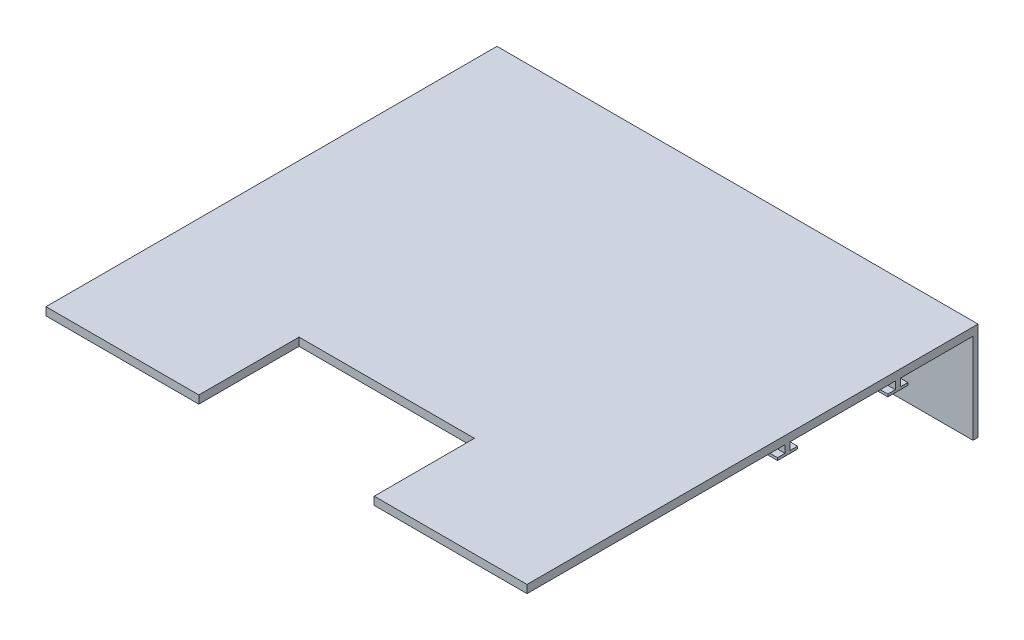
ISO-10303-21;
HEADER;
FILE_DESCRIPTION(('STEP AP214'),'2;1');
FILE_NAME('part.step','',(''),(''),'','','');
FILE_SCHEMA(('AUTOMOTIVE_DESIGN { 1 0 10303 214 1 1 1 1 }'));
ENDSEC;
DATA;
#1=APPLICATION_CONTEXT('core data for automotive mechanical design processes');
#2=APPLICATION_PROTOCOL_DEFINITION('international standard','automotive_design',2000,#1);
#3=PRODUCT_CONTEXT('',#1,'mechanical');
#4=PRODUCT('Part','Part','',(#3));
#5=PRODUCT_RELATED_PRODUCT_CATEGORY('part','',(#4));
#6=PRODUCT_DEFINITION_FORMATION('','',#4);
#7=PRODUCT_DEFINITION_CONTEXT('part definition',#1,'design');
#8=PRODUCT_DEFINITION('design','',#6,#7);
#9=PRODUCT_DEFINITION_SHAPE('','',#8);
#10=(LENGTH_UNIT() NAMED_UNIT(*) SI_UNIT(.MILLI.,.METRE.));
#11=(NAMED_UNIT(*) PLANE_ANGLE_UNIT() SI_UNIT($,.RADIAN.));
#12=(NAMED_UNIT(*) SI_UNIT($,.STERADIAN.) SOLID_ANGLE_UNIT());
#13=UNCERTAINTY_MEASURE_WITH_UNIT(LENGTH_MEASURE(1.E-05),#10,'distance_accuracy_value','');
#14=(GEOMETRIC_REPRESENTATION_CONTEXT(3) GLOBAL_UNCERTAINTY_ASSIGNED_CONTEXT((#13)) GLOBAL_UNIT_ASSIGNED_CONTEXT((#10,
#11,#12)) REPRESENTATION_CONTEXT('',''));
#15=CARTESIAN_POINT('',(0.,0.,0.));
#16=DIRECTION('',(0.,0.,1.));
#17=DIRECTION('',(1.,0.,0.));
#18=AXIS2_PLACEMENT_3D('',#15,#16,#17);
#19=CARTESIAN_POINT('',(0.,0.,0.));
#20=DIRECTION('',(0.,-1.,0.));
#21=DIRECTION('',(0.,0.,-1.));
#22=AXIS2_PLACEMENT_3D('',#19,#20,#21);
#23=PLANE('',#22);
#24=DIRECTION('',(-1.,0.,0.));
#25=VECTOR('',#24,1.);
#26=CARTESIAN_POINT('',(0.,0.,-262.5));
#27=LINE('',#26,#25);
#28=CARTESIAN_POINT('',(480.,0.,-262.5));
#29=VERTEX_POINT('',#28);
#30=CARTESIAN_POINT('',(0.,0.,-262.5));
#31=VERTEX_POINT('',#30);
#32=EDGE_CURVE('E62',#29,#31,#27,.T.);
#33=ORIENTED_EDGE('',*,*,#32,.T.);
#34=DIRECTION('',(0.,0.,1.));
#35=VECTOR('',#34,1.);
#36=CARTESIAN_POINT('',(0.,0.,0.));
#37=LINE('',#36,#35);
#38=CARTESIAN_POINT('',(0.,0.,-367.5));
#39=VERTEX_POINT('',#38);
#40=EDGE_CURVE('E400',#39,#31,#37,.T.);
#41=ORIENTED_EDGE('',*,*,#40,.F.);
#42=DIRECTION('',(-1.,0.,0.));
#43=VECTOR('',#42,1.);
#44=CARTESIAN_POINT('',(0.,0.,-367.5));
#45=LINE('',#44,#43);
#46=CARTESIAN_POINT('',(480.,0.,-367.5));
#47=VERTEX_POINT('',#46);
#48=EDGE_CURVE('E320',#47,#39,#45,.T.);
#49=ORIENTED_EDGE('',*,*,#48,.F.);
#50=DIRECTION('',(0.,0.,-1.));
#51=VECTOR('',#50,1.);
#52=CARTESIAN_POINT('',(480.,0.,0.));
#53=LINE('',#52,#51);
#54=EDGE_CURVE('E406',#29,#47,#53,.T.);
#55=ORIENTED_EDGE('',*,*,#54,.F.);
#56=EDGE_LOOP('',(#33,#41,#49,#55));
#57=FACE_BOUND('',#56,.T.);
#58=ADVANCED_FACE('F47',(#57),#23,.T.);
#59=CARTESIAN_POINT('',(480.,0.,-372.5));
#60=VERTEX_POINT('',#59);
#61=CARTESIAN_POINT('',(480.,0.,-445.));
#62=VERTEX_POINT('',#61);
#63=EDGE_CURVE('E404',#60,#62,#53,.T.);
#64=ORIENTED_EDGE('',*,*,#63,.F.);
#65=DIRECTION('',(1.,0.,0.));
#66=VECTOR('',#65,1.);
#67=CARTESIAN_POINT('',(0.,0.,-372.5));
#68=LINE('',#67,#66);
#69=CARTESIAN_POINT('',(0.,0.,-372.5));
#70=VERTEX_POINT('',#69);
#71=EDGE_CURVE('E315',#70,#60,#68,.T.);
#72=ORIENTED_EDGE('',*,*,#71,.F.);
#73=CARTESIAN_POINT('',(0.,0.,-445.));
#74=VERTEX_POINT('',#73);
#75=EDGE_CURVE('E396',#74,#70,#37,.T.);
#76=ORIENTED_EDGE('',*,*,#75,.F.);
#77=DIRECTION('',(-1.,0.,0.));
#78=VECTOR('',#77,1.);
#79=CARTESIAN_POINT('',(5.,0.,-445.));
#80=LINE('',#79,#78);
#81=EDGE_CURVE('E334',#62,#74,#80,.T.);
#82=ORIENTED_EDGE('',*,*,#81,.F.);
#83=EDGE_LOOP('',(#64,#72,#76,#82));
#84=FACE_BOUND('',#83,.T.);
#85=ADVANCED_FACE('F469',(#84),#23,.T.);
#86=DIRECTION('',(1.,0.,0.));
#87=VECTOR('',#86,1.);
#88=CARTESIAN_POINT('',(0.,0.,-257.5));
#89=LINE('',#88,#87);
#90=CARTESIAN_POINT('',(0.,0.,-257.5));
#91=VERTEX_POINT('',#90);
#92=CARTESIAN_POINT('',(480.,0.,-257.5));
#93=VERTEX_POINT('',#92);
#94=EDGE_CURVE('E269',#91,#93,#89,.T.);
#95=ORIENTED_EDGE('',*,*,#94,.T.);
#96=CARTESIAN_POINT('',(480.,0.,0.));
#97=VERTEX_POINT('',#96);
#98=EDGE_CURVE('E387',#97,#93,#53,.T.);
#99=ORIENTED_EDGE('',*,*,#98,.F.);
#100=DIRECTION('',(1.,0.,0.));
#101=VECTOR('',#100,1.);
#102=CARTESIAN_POINT('',(0.,0.,0.));
#103=LINE('',#102,#101);
#104=CARTESIAN_POINT('',(327.5,0.,0.));
#105=VERTEX_POINT('',#104);
#106=EDGE_CURVE('E399',#105,#97,#103,.T.);
#107=ORIENTED_EDGE('',*,*,#106,.F.);
#108=DIRECTION('',(0.,0.,1.));
#109=VECTOR('',#108,1.);
#110=CARTESIAN_POINT('',(327.5,0.,1.81799020282369E-13));
#111=LINE('',#110,#109);
#112=CARTESIAN_POINT('',(327.5,0.,-100.));
#113=VERTEX_POINT('',#112);
#114=EDGE_CURVE('E416',#113,#105,#111,.T.);
#115=ORIENTED_EDGE('',*,*,#114,.F.);
#116=DIRECTION('',(1.,0.,0.));
#117=VECTOR('',#116,1.);
#118=CARTESIAN_POINT('',(0.,0.,-100.));
#119=LINE('',#118,#117);
#120=CARTESIAN_POINT('',(152.5,0.,-100.));
#121=VERTEX_POINT('',#120);
#122=EDGE_CURVE('E55',#121,#113,#119,.T.);
#123=ORIENTED_EDGE('',*,*,#122,.F.);
#124=DIRECTION('',(0.,0.,-1.));
#125=VECTOR('',#124,1.);
#126=CARTESIAN_POINT('',(152.5,0.,0.));
#127=LINE('',#126,#125);
#128=CARTESIAN_POINT('',(152.5,0.,0.));
#129=VERTEX_POINT('',#128);
#130=EDGE_CURVE('E13',#129,#121,#127,.T.);
#131=ORIENTED_EDGE('',*,*,#130,.F.);
#132=CARTESIAN_POINT('',(0.,0.,0.));
#133=VERTEX_POINT('',#132);
#134=EDGE_CURVE('E401',#133,#129,#103,.T.);
#135=ORIENTED_EDGE('',*,*,#134,.F.);
#136=EDGE_CURVE('E376',#91,#133,#37,.T.);
#137=ORIENTED_EDGE('',*,*,#136,.F.);
#138=EDGE_LOOP('',(#95,#99,#107,#115,#123,#131,#135,#137));
#139=FACE_BOUND('',#138,.T.);
#140=CARTESIAN_POINT('',(450.,0.,-217.));
#141=DIRECTION('',(0.,-1.,0.));
#142=DIRECTION('',(0.,0.,1.));
#143=AXIS2_PLACEMENT_3D('',#140,#141,#142);
#144=CIRCLE('',#143,3.49999999999996);
#145=CARTESIAN_POINT('',(450.,0.,-213.5));
#146=VERTEX_POINT('',#145);
#147=EDGE_CURVE('E353',#146,#146,#144,.T.);
#148=ORIENTED_EDGE('',*,*,#147,.F.);
#149=EDGE_LOOP('',(#148));
#150=FACE_BOUND('',#149,.T.);
#151=CARTESIAN_POINT('',(30.,0.,-217.));
#152=DIRECTION('',(0.,-1.,0.));
#153=DIRECTION('',(0.,0.,-1.));
#154=AXIS2_PLACEMENT_3D('',#151,#152,#153);
#155=CIRCLE('',#154,3.5);
#156=CARTESIAN_POINT('',(30.,0.,-220.5));
#157=VERTEX_POINT('',#156);
#158=EDGE_CURVE('E357',#157,#157,#155,.T.);
#159=ORIENTED_EDGE('',*,*,#158,.F.);
#160=EDGE_LOOP('',(#159));
#161=FACE_BOUND('',#160,.T.);
#162=ADVANCED_FACE('F426',(#139,#150,#161),#23,.T.);
#163=CARTESIAN_POINT('',(0.,8.,0.));
#164=DIRECTION('',(0.,0.,-1.));
#165=DIRECTION('',(-1.,0.,0.));
#166=AXIS2_PLACEMENT_3D('',#163,#164,#165);
#167=PLANE('',#166);
#168=ORIENTED_EDGE('',*,*,#134,.T.);
#169=DIRECTION('',(0.,1.,0.));
#170=VECTOR('',#169,1.);
#171=CARTESIAN_POINT('',(152.5,-2.,0.));
#172=LINE('',#171,#170);
#173=CARTESIAN_POINT('',(152.5,8.,0.));
#174=VERTEX_POINT('',#173);
#175=EDGE_CURVE('E373',#129,#174,#172,.T.);
#176=ORIENTED_EDGE('',*,*,#175,.T.);
#177=DIRECTION('',(1.,0.,0.));
#178=VECTOR('',#177,1.);
#179=CARTESIAN_POINT('',(0.,8.,0.));
#180=LINE('',#179,#178);
#181=CARTESIAN_POINT('',(0.,8.,0.));
#182=VERTEX_POINT('',#181);
#183=EDGE_CURVE('E388',#182,#174,#180,.T.);
#184=ORIENTED_EDGE('',*,*,#183,.F.);
#185=DIRECTION('',(0.,-1.,0.));
#186=VECTOR('',#185,1.);
#187=CARTESIAN_POINT('',(0.,8.,0.));
#188=LINE('',#187,#186);
#189=EDGE_CURVE('E413',#182,#133,#188,.T.);
#190=ORIENTED_EDGE('',*,*,#189,.T.);
#191=EDGE_LOOP('',(#168,#176,#184,#190));
#192=FACE_BOUND('',#191,.T.);
#193=ADVANCED_FACE('F446',(#192),#167,.F.);
#194=CARTESIAN_POINT('',(0.,8.,0.));
#195=DIRECTION('',(1.,0.,0.));
#196=DIRECTION('',(0.,0.,-1.));
#197=AXIS2_PLACEMENT_3D('',#194,#195,#196);
#198=PLANE('',#197);
#199=DIRECTION('',(0.,-1.,0.));
#200=VECTOR('',#199,1.);
#201=CARTESIAN_POINT('',(0.,8.,-450.));
#202=LINE('',#201,#200);
#203=CARTESIAN_POINT('',(0.,8.,-450.));
#204=VERTEX_POINT('',#203);
#205=CARTESIAN_POINT('',(0.,-90.,-450.));
#206=VERTEX_POINT('',#205);
#207=EDGE_CURVE('E395',#204,#206,#202,.T.);
#208=ORIENTED_EDGE('',*,*,#207,.T.);
#209=DIRECTION('',(0.,0.,-1.));
#210=VECTOR('',#209,1.);
#211=CARTESIAN_POINT('',(0.,-90.,-445.));
#212=LINE('',#211,#210);
#213=CARTESIAN_POINT('',(0.,-90.,-445.));
#214=VERTEX_POINT('',#213);
#215=EDGE_CURVE('E340',#214,#206,#212,.T.);
#216=ORIENTED_EDGE('',*,*,#215,.F.);
#217=DIRECTION('',(0.,1.,0.));
#218=VECTOR('',#217,1.);
#219=CARTESIAN_POINT('',(0.,-90.,-445.));
#220=LINE('',#219,#218);
#221=EDGE_CURVE('E346',#214,#74,#220,.T.);
#222=ORIENTED_EDGE('',*,*,#221,.T.);
#223=ORIENTED_EDGE('',*,*,#75,.T.);
#224=DIRECTION('',(0.,1.,0.));
#225=VECTOR('',#224,1.);
#226=CARTESIAN_POINT('',(0.,-7.5,-372.5));
#227=LINE('',#226,#225);
#228=CARTESIAN_POINT('',(0.,-7.5,-372.5));
#229=VERTEX_POINT('',#228);
#230=EDGE_CURVE('E332',#229,#70,#227,.T.);
#231=ORIENTED_EDGE('',*,*,#230,.F.);
#232=DIRECTION('',(0.,0.,-1.));
#233=VECTOR('',#232,1.);
#234=CARTESIAN_POINT('',(0.,-7.5,-360.));
#235=LINE('',#234,#233);
#236=CARTESIAN_POINT('',(0.,-7.5,-380.));
#237=VERTEX_POINT('',#236);
#238=EDGE_CURVE('E299',#229,#237,#235,.T.);
#239=ORIENTED_EDGE('',*,*,#238,.T.);
#240=DIRECTION('',(0.,1.,0.));
#241=VECTOR('',#240,1.);
#242=CARTESIAN_POINT('',(0.,-10.,-380.));
#243=LINE('',#242,#241);
#244=CARTESIAN_POINT('',(0.,-10.,-380.));
#245=VERTEX_POINT('',#244);
#246=EDGE_CURVE('E306',#245,#237,#243,.T.);
#247=ORIENTED_EDGE('',*,*,#246,.F.);
#248=DIRECTION('',(0.,0.,-1.));
#249=VECTOR('',#248,1.);
#250=CARTESIAN_POINT('',(0.,-10.,-360.));
#251=LINE('',#250,#249);
#252=CARTESIAN_POINT('',(0.,-10.,-360.));
#253=VERTEX_POINT('',#252);
#254=EDGE_CURVE('E290',#253,#245,#251,.T.);
#255=ORIENTED_EDGE('',*,*,#254,.F.);
#256=DIRECTION('',(0.,1.,0.));
#257=VECTOR('',#256,1.);
#258=CARTESIAN_POINT('',(0.,-10.,-360.));
#259=LINE('',#258,#257);
#260=CARTESIAN_POINT('',(0.,-7.5,-360.));
#261=VERTEX_POINT('',#260);
#262=EDGE_CURVE('E309',#253,#261,#259,.T.);
#263=ORIENTED_EDGE('',*,*,#262,.T.);
#264=CARTESIAN_POINT('',(0.,-7.5,-367.5));
#265=VERTEX_POINT('',#264);
#266=EDGE_CURVE('E300',#261,#265,#235,.T.);
#267=ORIENTED_EDGE('',*,*,#266,.T.);
#268=DIRECTION('',(0.,1.,0.));
#269=VECTOR('',#268,1.);
#270=CARTESIAN_POINT('',(0.,-7.5,-367.5));
#271=LINE('',#270,#269);
#272=EDGE_CURVE('E323',#265,#39,#271,.T.);
#273=ORIENTED_EDGE('',*,*,#272,.T.);
#274=ORIENTED_EDGE('',*,*,#40,.T.);
#275=DIRECTION('',(0.,1.,0.));
#276=VECTOR('',#275,1.);
#277=CARTESIAN_POINT('',(0.,-7.5,-262.5));
#278=LINE('',#277,#276);
#279=CARTESIAN_POINT('',(0.,-7.5,-262.5));
#280=VERTEX_POINT('',#279);
#281=EDGE_CURVE('E281',#280,#31,#278,.T.);
#282=ORIENTED_EDGE('',*,*,#281,.F.);
#283=DIRECTION('',(0.,0.,1.));
#284=VECTOR('',#283,1.);
#285=CARTESIAN_POINT('',(0.,-7.5,-270.));
#286=LINE('',#285,#284);
#287=CARTESIAN_POINT('',(0.,-7.5,-270.));
#288=VERTEX_POINT('',#287);
#289=EDGE_CURVE('E257',#288,#280,#286,.T.);
#290=ORIENTED_EDGE('',*,*,#289,.F.);
#291=DIRECTION('',(0.,1.,0.));
#292=VECTOR('',#291,1.);
#293=CARTESIAN_POINT('',(0.,-10.,-270.));
#294=LINE('',#293,#292);
#295=CARTESIAN_POINT('',(0.,-10.,-270.));
#296=VERTEX_POINT('',#295);
#297=EDGE_CURVE('E262',#296,#288,#294,.T.);
#298=ORIENTED_EDGE('',*,*,#297,.F.);
#299=DIRECTION('',(0.,0.,1.));
#300=VECTOR('',#299,1.);
#301=CARTESIAN_POINT('',(0.,-10.,-270.));
#302=LINE('',#301,#300);
#303=CARTESIAN_POINT('',(0.,-10.,-250.));
#304=VERTEX_POINT('',#303);
#305=EDGE_CURVE('E246',#296,#304,#302,.T.);
#306=ORIENTED_EDGE('',*,*,#305,.T.);
#307=DIRECTION('',(0.,1.,0.));
#308=VECTOR('',#307,1.);
#309=CARTESIAN_POINT('',(0.,-10.,-250.));
#310=LINE('',#309,#308);
#311=CARTESIAN_POINT('',(0.,-7.5,-250.));
#312=VERTEX_POINT('',#311);
#313=EDGE_CURVE('E232',#304,#312,#310,.T.);
#314=ORIENTED_EDGE('',*,*,#313,.T.);
#315=CARTESIAN_POINT('',(0.,-7.5,-257.5));
#316=VERTEX_POINT('',#315);
#317=EDGE_CURVE('E256',#316,#312,#286,.T.);
#318=ORIENTED_EDGE('',*,*,#317,.F.);
#319=DIRECTION('',(0.,1.,0.));
#320=VECTOR('',#319,1.);
#321=CARTESIAN_POINT('',(0.,-7.5,-257.5));
#322=LINE('',#321,#320);
#323=EDGE_CURVE('E272',#316,#91,#322,.T.);
#324=ORIENTED_EDGE('',*,*,#323,.T.);
#325=ORIENTED_EDGE('',*,*,#136,.T.);
#326=ORIENTED_EDGE('',*,*,#189,.F.);
#327=DIRECTION('',(0.,0.,1.));
#328=VECTOR('',#327,1.);
#329=CARTESIAN_POINT('',(0.,8.,0.));
#330=LINE('',#329,#328);
#331=EDGE_CURVE('E383',#204,#182,#330,.T.);
#332=ORIENTED_EDGE('',*,*,#331,.F.);
#333=EDGE_LOOP('',(#208,#216,#222,#223,#231,#239,#247,#255,#263,#267,#273,#274,#282,#290,#298,
#306,#314,#318,#324,#325,#326,#332));
#334=FACE_BOUND('',#333,.T.);
#335=ADVANCED_FACE('F49',(#334),#198,.F.);
#336=CARTESIAN_POINT('',(327.5,8.,0.));
#337=VERTEX_POINT('',#336);
#338=CARTESIAN_POINT('',(480.,8.,0.));
#339=VERTEX_POINT('',#338);
#340=EDGE_CURVE('E386',#337,#339,#180,.T.);
#341=ORIENTED_EDGE('',*,*,#340,.F.);
#342=DIRECTION('',(0.,1.,0.));
#343=VECTOR('',#342,1.);
#344=CARTESIAN_POINT('',(327.5,-2.,0.));
#345=LINE('',#344,#343);
#346=EDGE_CURVE('E379',#105,#337,#345,.T.);
#347=ORIENTED_EDGE('',*,*,#346,.F.);
#348=ORIENTED_EDGE('',*,*,#106,.T.);
#349=DIRECTION('',(0.,-1.,0.));
#350=VECTOR('',#349,1.);
#351=CARTESIAN_POINT('',(480.,8.,0.));
#352=LINE('',#351,#350);
#353=EDGE_CURVE('E410',#339,#97,#352,.T.);
#354=ORIENTED_EDGE('',*,*,#353,.F.);
#355=EDGE_LOOP('',(#341,#347,#348,#354));
#356=FACE_BOUND('',#355,.T.);
#357=ADVANCED_FACE('F435',(#356),#167,.F.);
#358=CARTESIAN_POINT('',(480.,8.,0.));
#359=DIRECTION('',(-1.,0.,0.));
#360=DIRECTION('',(0.,0.,1.));
#361=AXIS2_PLACEMENT_3D('',#358,#359,#360);
#362=PLANE('',#361);
#363=ORIENTED_EDGE('',*,*,#98,.T.);
#364=DIRECTION('',(0.,1.,0.));
#365=VECTOR('',#364,1.);
#366=CARTESIAN_POINT('',(480.,-7.5,-257.5));
#367=LINE('',#366,#365);
#368=CARTESIAN_POINT('',(480.,-7.5,-257.5));
#369=VERTEX_POINT('',#368);
#370=EDGE_CURVE('E277',#369,#93,#367,.T.);
#371=ORIENTED_EDGE('',*,*,#370,.F.);
#372=DIRECTION('',(0.,0.,-1.));
#373=VECTOR('',#372,1.);
#374=CARTESIAN_POINT('',(480.,-7.5,-270.));
#375=LINE('',#374,#373);
#376=CARTESIAN_POINT('',(480.,-7.5,-250.));
#377=VERTEX_POINT('',#376);
#378=EDGE_CURVE('E227',#377,#369,#375,.T.);
#379=ORIENTED_EDGE('',*,*,#378,.F.);
#380=DIRECTION('',(0.,1.,0.));
#381=VECTOR('',#380,1.);
#382=CARTESIAN_POINT('',(480.,-10.,-250.));
#383=LINE('',#382,#381);
#384=CARTESIAN_POINT('',(480.,-10.,-250.));
#385=VERTEX_POINT('',#384);
#386=EDGE_CURVE('E219',#385,#377,#383,.T.);
#387=ORIENTED_EDGE('',*,*,#386,.F.);
#388=DIRECTION('',(0.,0.,-1.));
#389=VECTOR('',#388,1.);
#390=CARTESIAN_POINT('',(480.,-10.,-270.));
#391=LINE('',#390,#389);
#392=CARTESIAN_POINT('',(480.,-10.,-270.));
#393=VERTEX_POINT('',#392);
#394=EDGE_CURVE('E224',#385,#393,#391,.T.);
#395=ORIENTED_EDGE('',*,*,#394,.T.);
#396=DIRECTION('',(0.,1.,0.));
#397=VECTOR('',#396,1.);
#398=CARTESIAN_POINT('',(480.,-10.,-270.));
#399=LINE('',#398,#397);
#400=CARTESIAN_POINT('',(480.,-7.5,-270.));
#401=VERTEX_POINT('',#400);
#402=EDGE_CURVE('E251',#393,#401,#399,.T.);
#403=ORIENTED_EDGE('',*,*,#402,.T.);
#404=CARTESIAN_POINT('',(480.,-7.5,-262.5));
#405=VERTEX_POINT('',#404);
#406=EDGE_CURVE('E254',#405,#401,#375,.T.);
#407=ORIENTED_EDGE('',*,*,#406,.F.);
#408=DIRECTION('',(0.,1.,0.));
#409=VECTOR('',#408,1.);
#410=CARTESIAN_POINT('',(480.,-7.5,-262.5));
#411=LINE('',#410,#409);
#412=EDGE_CURVE('E279',#405,#29,#411,.T.);
#413=ORIENTED_EDGE('',*,*,#412,.T.);
#414=ORIENTED_EDGE('',*,*,#54,.T.);
#415=DIRECTION('',(0.,1.,0.));
#416=VECTOR('',#415,1.);
#417=CARTESIAN_POINT('',(480.,-7.5,-367.5));
#418=LINE('',#417,#416);
#419=CARTESIAN_POINT('',(480.,-7.5,-367.5));
#420=VERTEX_POINT('',#419);
#421=EDGE_CURVE('E328',#420,#47,#418,.T.);
#422=ORIENTED_EDGE('',*,*,#421,.F.);
#423=DIRECTION('',(0.,0.,1.));
#424=VECTOR('',#423,1.);
#425=CARTESIAN_POINT('',(480.,-7.5,-360.));
#426=LINE('',#425,#424);
#427=CARTESIAN_POINT('',(480.,-7.5,-360.));
#428=VERTEX_POINT('',#427);
#429=EDGE_CURVE('E283',#420,#428,#426,.T.);
#430=ORIENTED_EDGE('',*,*,#429,.T.);
#431=DIRECTION('',(0.,1.,0.));
#432=VECTOR('',#431,1.);
#433=CARTESIAN_POINT('',(480.,-10.,-360.));
#434=LINE('',#433,#432);
#435=CARTESIAN_POINT('',(480.,-10.,-360.));
#436=VERTEX_POINT('',#435);
#437=EDGE_CURVE('E312',#436,#428,#434,.T.);
#438=ORIENTED_EDGE('',*,*,#437,.F.);
#439=DIRECTION('',(0.,0.,1.));
#440=VECTOR('',#439,1.);
#441=CARTESIAN_POINT('',(480.,-10.,-360.));
#442=LINE('',#441,#440);
#443=CARTESIAN_POINT('',(480.,-10.,-380.));
#444=VERTEX_POINT('',#443);
#445=EDGE_CURVE('E284',#444,#436,#442,.T.);
#446=ORIENTED_EDGE('',*,*,#445,.F.);
#447=DIRECTION('',(0.,1.,0.));
#448=VECTOR('',#447,1.);
#449=CARTESIAN_POINT('',(480.,-10.,-380.));
#450=LINE('',#449,#448);
#451=CARTESIAN_POINT('',(480.,-7.5,-380.));
#452=VERTEX_POINT('',#451);
#453=EDGE_CURVE('E294',#444,#452,#450,.T.);
#454=ORIENTED_EDGE('',*,*,#453,.T.);
#455=CARTESIAN_POINT('',(480.,-7.5,-372.5));
#456=VERTEX_POINT('',#455);
#457=EDGE_CURVE('E295',#452,#456,#426,.T.);
#458=ORIENTED_EDGE('',*,*,#457,.T.);
#459=DIRECTION('',(0.,1.,0.));
#460=VECTOR('',#459,1.);
#461=CARTESIAN_POINT('',(480.,-7.5,-372.5));
#462=LINE('',#461,#460);
#463=EDGE_CURVE('E70',#456,#60,#462,.T.);
#464=ORIENTED_EDGE('',*,*,#463,.T.);
#465=ORIENTED_EDGE('',*,*,#63,.T.);
#466=DIRECTION('',(0.,1.,0.));
#467=VECTOR('',#466,1.);
#468=CARTESIAN_POINT('',(480.,-90.,-445.));
#469=LINE('',#468,#467);
#470=CARTESIAN_POINT('',(480.,-90.,-445.));
#471=VERTEX_POINT('',#470);
#472=EDGE_CURVE('E350',#471,#62,#469,.T.);
#473=ORIENTED_EDGE('',*,*,#472,.F.);
#474=DIRECTION('',(0.,0.,1.));
#475=VECTOR('',#474,1.);
#476=CARTESIAN_POINT('',(480.,-90.,-445.));
#477=LINE('',#476,#475);
#478=CARTESIAN_POINT('',(480.,-90.,-450.));
#479=VERTEX_POINT('',#478);
#480=EDGE_CURVE('E335',#479,#471,#477,.T.);
#481=ORIENTED_EDGE('',*,*,#480,.F.);
#482=DIRECTION('',(0.,-1.,0.));
#483=VECTOR('',#482,1.);
#484=CARTESIAN_POINT('',(480.,8.,-450.));
#485=LINE('',#484,#483);
#486=CARTESIAN_POINT('',(480.,8.,-450.));
#487=VERTEX_POINT('',#486);
#488=EDGE_CURVE('E408',#487,#479,#485,.T.);
#489=ORIENTED_EDGE('',*,*,#488,.F.);
#490=DIRECTION('',(0.,0.,-1.));
#491=VECTOR('',#490,1.);
#492=CARTESIAN_POINT('',(480.,8.,0.));
#493=LINE('',#492,#491);
#494=EDGE_CURVE('E391',#339,#487,#493,.T.);
#495=ORIENTED_EDGE('',*,*,#494,.F.);
#496=ORIENTED_EDGE('',*,*,#353,.T.);
#497=EDGE_LOOP('',(#363,#371,#379,#387,#395,#403,#407,#413,#414,#422,#430,#438,#446,#454,#458,
#464,#465,#473,#481,#489,#495,#496));
#498=FACE_BOUND('',#497,.T.);
#499=ADVANCED_FACE('F222',(#498),#362,.F.);
#500=CARTESIAN_POINT('',(0.,8.,-450.));
#501=DIRECTION('',(0.,0.,1.));
#502=DIRECTION('',(1.,0.,0.));
#503=AXIS2_PLACEMENT_3D('',#500,#501,#502);
#504=PLANE('',#503);
#505=ORIENTED_EDGE('',*,*,#488,.T.);
#506=DIRECTION('',(1.,0.,0.));
#507=VECTOR('',#506,1.);
#508=CARTESIAN_POINT('',(480.,-90.,-450.));
#509=LINE('',#508,#507);
#510=EDGE_CURVE('E343',#206,#479,#509,.T.);
#511=ORIENTED_EDGE('',*,*,#510,.F.);
#512=ORIENTED_EDGE('',*,*,#207,.F.);
#513=DIRECTION('',(-1.,0.,0.));
#514=VECTOR('',#513,1.);
#515=CARTESIAN_POINT('',(0.,8.,-450.));
#516=LINE('',#515,#514);
#517=EDGE_CURVE('E393',#487,#204,#516,.T.);
#518=ORIENTED_EDGE('',*,*,#517,.F.);
#519=EDGE_LOOP('',(#505,#511,#512,#518));
#520=FACE_BOUND('',#519,.T.);
#521=ADVANCED_FACE('F478',(#520),#504,.F.);
#522=CARTESIAN_POINT('',(0.,8.,0.));
#523=DIRECTION('',(0.,-1.,0.));
#524=DIRECTION('',(0.,0.,-1.));
#525=AXIS2_PLACEMENT_3D('',#522,#523,#524);
#526=PLANE('',#525);
#527=ORIENTED_EDGE('',*,*,#183,.T.);
#528=DIRECTION('',(0.,0.,1.));
#529=VECTOR('',#528,1.);
#530=CARTESIAN_POINT('',(152.5,8.,0.));
#531=LINE('',#530,#529);
#532=CARTESIAN_POINT('',(152.5,8.,-100.));
#533=VERTEX_POINT('',#532);
#534=EDGE_CURVE('E363',#533,#174,#531,.T.);
#535=ORIENTED_EDGE('',*,*,#534,.F.);
#536=DIRECTION('',(-1.,0.,0.));
#537=VECTOR('',#536,1.);
#538=CARTESIAN_POINT('',(152.5,8.,-100.));
#539=LINE('',#538,#537);
#540=CARTESIAN_POINT('',(327.5,8.,-100.));
#541=VERTEX_POINT('',#540);
#542=EDGE_CURVE('E370',#541,#533,#539,.T.);
#543=ORIENTED_EDGE('',*,*,#542,.F.);
#544=DIRECTION('',(0.,0.,-1.));
#545=VECTOR('',#544,1.);
#546=CARTESIAN_POINT('',(327.5,8.,0.));
#547=LINE('',#546,#545);
#548=EDGE_CURVE('E367',#337,#541,#547,.T.);
#549=ORIENTED_EDGE('',*,*,#548,.F.);
#550=ORIENTED_EDGE('',*,*,#340,.T.);
#551=ORIENTED_EDGE('',*,*,#494,.T.);
#552=ORIENTED_EDGE('',*,*,#517,.T.);
#553=ORIENTED_EDGE('',*,*,#331,.T.);
#554=EDGE_LOOP('',(#527,#535,#543,#549,#550,#551,#552,#553));
#555=FACE_BOUND('',#554,.T.);
#556=ADVANCED_FACE('F439',(#555),#526,.F.);
#557=CARTESIAN_POINT('',(152.5,-2.,0.));
#558=DIRECTION('',(-1.,0.,0.));
#559=DIRECTION('',(0.,0.,1.));
#560=AXIS2_PLACEMENT_3D('',#557,#558,#559);
#561=PLANE('',#560);
#562=ORIENTED_EDGE('',*,*,#130,.T.);
#563=DIRECTION('',(0.,1.,0.));
#564=VECTOR('',#563,1.);
#565=CARTESIAN_POINT('',(152.5,-2.,-100.));
#566=LINE('',#565,#564);
#567=EDGE_CURVE('E374',#121,#533,#566,.T.);
#568=ORIENTED_EDGE('',*,*,#567,.T.);
#569=ORIENTED_EDGE('',*,*,#534,.T.);
#570=ORIENTED_EDGE('',*,*,#175,.F.);
#571=EDGE_LOOP('',(#562,#568,#569,#570));
#572=FACE_BOUND('',#571,.T.);
#573=ADVANCED_FACE('F444',(#572),#561,.F.);
#574=CARTESIAN_POINT('',(152.5,-2.,-100.));
#575=DIRECTION('',(0.,0.,-1.));
#576=DIRECTION('',(-1.,0.,0.));
#577=AXIS2_PLACEMENT_3D('',#574,#575,#576);
#578=PLANE('',#577);
#579=ORIENTED_EDGE('',*,*,#122,.T.);
#580=DIRECTION('',(0.,1.,0.));
#581=VECTOR('',#580,1.);
#582=CARTESIAN_POINT('',(327.5,-2.,-100.));
#583=LINE('',#582,#581);
#584=EDGE_CURVE('E377',#113,#541,#583,.T.);
#585=ORIENTED_EDGE('',*,*,#584,.T.);
#586=ORIENTED_EDGE('',*,*,#542,.T.);
#587=ORIENTED_EDGE('',*,*,#567,.F.);
#588=EDGE_LOOP('',(#579,#585,#586,#587));
#589=FACE_BOUND('',#588,.T.);
#590=ADVANCED_FACE('F422',(#589),#578,.F.);
#591=CARTESIAN_POINT('',(327.5,-2.,0.));
#592=DIRECTION('',(1.,0.,0.));
#593=DIRECTION('',(0.,0.,-1.));
#594=AXIS2_PLACEMENT_3D('',#591,#592,#593);
#595=PLANE('',#594);
#596=ORIENTED_EDGE('',*,*,#114,.T.);
#597=ORIENTED_EDGE('',*,*,#346,.T.);
#598=ORIENTED_EDGE('',*,*,#548,.T.);
#599=ORIENTED_EDGE('',*,*,#584,.F.);
#600=EDGE_LOOP('',(#596,#597,#598,#599));
#601=FACE_BOUND('',#600,.T.);
#602=ADVANCED_FACE('F431',(#601),#595,.F.);
#603=CARTESIAN_POINT('',(30.,-15.,-217.));
#604=DIRECTION('',(0.,1.,0.));
#605=DIRECTION('',(0.,0.,1.));
#606=AXIS2_PLACEMENT_3D('',#603,#604,#605);
#607=CYLINDRICAL_SURFACE('',#606,3.5);
#608=CARTESIAN_POINT('',(30.,-15.,-217.));
#609=DIRECTION('',(0.,-1.,0.));
#610=DIRECTION('',(0.,0.,-1.));
#611=AXIS2_PLACEMENT_3D('',#608,#609,#610);
#612=CIRCLE('',#611,3.5);
#613=CARTESIAN_POINT('',(30.,-15.,-220.5));
#614=VERTEX_POINT('',#613);
#615=EDGE_CURVE('E360',#614,#614,#612,.T.);
#616=ORIENTED_EDGE('',*,*,#615,.F.);
#617=EDGE_LOOP('',(#616));
#618=FACE_BOUND('',#617,.T.);
#619=ORIENTED_EDGE('',*,*,#158,.T.);
#620=EDGE_LOOP('',(#619));
#621=FACE_BOUND('',#620,.T.);
#622=ADVANCED_FACE('F539',(#618,#621),#607,.T.);
#623=CARTESIAN_POINT('',(30.,-15.,-217.));
#624=DIRECTION('',(0.,-1.,0.));
#625=DIRECTION('',(0.,0.,-1.));
#626=AXIS2_PLACEMENT_3D('',#623,#624,#625);
#627=PLANE('',#626);
#628=ORIENTED_EDGE('',*,*,#615,.T.);
#629=EDGE_LOOP('',(#628));
#630=FACE_BOUND('',#629,.T.);
#631=ADVANCED_FACE('F544',(#630),#627,.T.);
#632=CARTESIAN_POINT('',(450.,-15.,-217.));
#633=DIRECTION('',(0.,1.,0.));
#634=DIRECTION('',(0.,0.,1.));
#635=AXIS2_PLACEMENT_3D('',#632,#633,#634);
#636=CYLINDRICAL_SURFACE('',#635,3.49999999999996);
#637=CARTESIAN_POINT('',(450.,-15.,-217.));
#638=DIRECTION('',(0.,-1.,0.));
#639=DIRECTION('',(0.,0.,1.));
#640=AXIS2_PLACEMENT_3D('',#637,#638,#639);
#641=CIRCLE('',#640,3.49999999999996);
#642=CARTESIAN_POINT('',(450.,-15.,-213.5));
#643=VERTEX_POINT('',#642);
#644=EDGE_CURVE('E354',#643,#643,#641,.T.);
#645=ORIENTED_EDGE('',*,*,#644,.F.);
#646=EDGE_LOOP('',(#645));
#647=FACE_BOUND('',#646,.T.);
#648=ORIENTED_EDGE('',*,*,#147,.T.);
#649=EDGE_LOOP('',(#648));
#650=FACE_BOUND('',#649,.T.);
#651=ADVANCED_FACE('F548',(#647,#650),#636,.T.);
#652=CARTESIAN_POINT('',(450.,-15.,-217.));
#653=DIRECTION('',(0.,1.,0.));
#654=DIRECTION('',(0.,0.,1.));
#655=AXIS2_PLACEMENT_3D('',#652,#653,#654);
#656=PLANE('',#655);
#657=ORIENTED_EDGE('',*,*,#644,.T.);
#658=EDGE_LOOP('',(#657));
#659=FACE_BOUND('',#658,.T.);
#660=ADVANCED_FACE('F552',(#659),#656,.F.);
#661=CARTESIAN_POINT('',(5.,-90.,-445.));
#662=DIRECTION('',(0.,0.,-1.));
#663=DIRECTION('',(-1.,0.,0.));
#664=AXIS2_PLACEMENT_3D('',#661,#662,#663);
#665=PLANE('',#664);
#666=ORIENTED_EDGE('',*,*,#81,.T.);
#667=ORIENTED_EDGE('',*,*,#221,.F.);
#668=DIRECTION('',(-1.,0.,0.));
#669=VECTOR('',#668,1.);
#670=CARTESIAN_POINT('',(475.,-90.,-445.));
#671=LINE('',#670,#669);
#672=EDGE_CURVE('E338',#471,#214,#671,.T.);
#673=ORIENTED_EDGE('',*,*,#672,.F.);
#674=ORIENTED_EDGE('',*,*,#472,.T.);
#675=EDGE_LOOP('',(#666,#667,#673,#674));
#676=FACE_BOUND('',#675,.T.);
#677=ADVANCED_FACE('F466',(#676),#665,.F.);
#678=CARTESIAN_POINT('',(0.,-90.,0.));
#679=DIRECTION('',(0.,1.,0.));
#680=DIRECTION('',(0.,0.,1.));
#681=AXIS2_PLACEMENT_3D('',#678,#679,#680);
#682=PLANE('',#681);
#683=ORIENTED_EDGE('',*,*,#480,.T.);
#684=ORIENTED_EDGE('',*,*,#672,.T.);
#685=ORIENTED_EDGE('',*,*,#215,.T.);
#686=ORIENTED_EDGE('',*,*,#510,.T.);
#687=EDGE_LOOP('',(#683,#684,#685,#686));
#688=FACE_BOUND('',#687,.T.);
#689=ADVANCED_FACE('F476',(#688),#682,.F.);
#690=CARTESIAN_POINT('',(0.,-7.5,-372.5));
#691=DIRECTION('',(0.,0.,1.));
#692=DIRECTION('',(1.,0.,0.));
#693=AXIS2_PLACEMENT_3D('',#690,#691,#692);
#694=PLANE('',#693);
#695=ORIENTED_EDGE('',*,*,#71,.T.);
#696=ORIENTED_EDGE('',*,*,#463,.F.);
#697=DIRECTION('',(1.,0.,0.));
#698=VECTOR('',#697,1.);
#699=CARTESIAN_POINT('',(0.,-7.5,-372.5));
#700=LINE('',#699,#698);
#701=EDGE_CURVE('E316',#229,#456,#700,.T.);
#702=ORIENTED_EDGE('',*,*,#701,.F.);
#703=ORIENTED_EDGE('',*,*,#230,.T.);
#704=EDGE_LOOP('',(#695,#696,#702,#703));
#705=FACE_BOUND('',#704,.T.);
#706=ADVANCED_FACE('F560',(#705),#694,.F.);
#707=CARTESIAN_POINT('',(0.,-7.5,-367.5));
#708=DIRECTION('',(0.,0.,-1.));
#709=DIRECTION('',(-1.,0.,0.));
#710=AXIS2_PLACEMENT_3D('',#707,#708,#709);
#711=PLANE('',#710);
#712=ORIENTED_EDGE('',*,*,#48,.T.);
#713=ORIENTED_EDGE('',*,*,#272,.F.);
#714=DIRECTION('',(-1.,0.,0.));
#715=VECTOR('',#714,1.);
#716=CARTESIAN_POINT('',(0.,-7.5,-367.5));
#717=LINE('',#716,#715);
#718=EDGE_CURVE('E319',#420,#265,#717,.T.);
#719=ORIENTED_EDGE('',*,*,#718,.F.);
#720=ORIENTED_EDGE('',*,*,#421,.T.);
#721=EDGE_LOOP('',(#712,#713,#719,#720));
#722=FACE_BOUND('',#721,.T.);
#723=ADVANCED_FACE('F563',(#722),#711,.F.);
#724=CARTESIAN_POINT('',(0.,-7.5,0.));
#725=DIRECTION('',(0.,-1.,0.));
#726=DIRECTION('',(0.,0.,-1.));
#727=AXIS2_PLACEMENT_3D('',#724,#725,#726);
#728=PLANE('',#727);
#729=ORIENTED_EDGE('',*,*,#238,.F.);
#730=ORIENTED_EDGE('',*,*,#701,.T.);
#731=ORIENTED_EDGE('',*,*,#457,.F.);
#732=DIRECTION('',(1.,0.,0.));
#733=VECTOR('',#732,1.);
#734=CARTESIAN_POINT('',(0.,-7.5,-380.));
#735=LINE('',#734,#733);
#736=EDGE_CURVE('E288',#237,#452,#735,.T.);
#737=ORIENTED_EDGE('',*,*,#736,.F.);
#738=EDGE_LOOP('',(#729,#730,#731,#737));
#739=FACE_BOUND('',#738,.T.);
#740=ADVANCED_FACE('F567',(#739),#728,.F.);
#741=ORIENTED_EDGE('',*,*,#429,.F.);
#742=ORIENTED_EDGE('',*,*,#718,.T.);
#743=ORIENTED_EDGE('',*,*,#266,.F.);
#744=DIRECTION('',(-1.,0.,0.));
#745=VECTOR('',#744,1.);
#746=CARTESIAN_POINT('',(480.,-7.5,-360.));
#747=LINE('',#746,#745);
#748=EDGE_CURVE('E297',#428,#261,#747,.T.);
#749=ORIENTED_EDGE('',*,*,#748,.F.);
#750=EDGE_LOOP('',(#741,#742,#743,#749));
#751=FACE_BOUND('',#750,.T.);
#752=ADVANCED_FACE('F573',(#751),#728,.F.);
#753=CARTESIAN_POINT('',(480.,-10.,-360.));
#754=DIRECTION('',(0.,0.,-1.));
#755=DIRECTION('',(-1.,0.,0.));
#756=AXIS2_PLACEMENT_3D('',#753,#754,#755);
#757=PLANE('',#756);
#758=ORIENTED_EDGE('',*,*,#748,.T.);
#759=ORIENTED_EDGE('',*,*,#262,.F.);
#760=DIRECTION('',(-1.,0.,0.));
#761=VECTOR('',#760,1.);
#762=CARTESIAN_POINT('',(480.,-10.,-360.));
#763=LINE('',#762,#761);
#764=EDGE_CURVE('E287',#436,#253,#763,.T.);
#765=ORIENTED_EDGE('',*,*,#764,.F.);
#766=ORIENTED_EDGE('',*,*,#437,.T.);
#767=EDGE_LOOP('',(#758,#759,#765,#766));
#768=FACE_BOUND('',#767,.T.);
#769=ADVANCED_FACE('F569',(#768),#757,.F.);
#770=CARTESIAN_POINT('',(0.,-10.,-380.));
#771=DIRECTION('',(0.,0.,1.));
#772=DIRECTION('',(1.,0.,0.));
#773=AXIS2_PLACEMENT_3D('',#770,#771,#772);
#774=PLANE('',#773);
#775=ORIENTED_EDGE('',*,*,#736,.T.);
#776=ORIENTED_EDGE('',*,*,#453,.F.);
#777=DIRECTION('',(1.,0.,0.));
#778=VECTOR('',#777,1.);
#779=CARTESIAN_POINT('',(0.,-10.,-380.));
#780=LINE('',#779,#778);
#781=EDGE_CURVE('E292',#245,#444,#780,.T.);
#782=ORIENTED_EDGE('',*,*,#781,.F.);
#783=ORIENTED_EDGE('',*,*,#246,.T.);
#784=EDGE_LOOP('',(#775,#776,#782,#783));
#785=FACE_BOUND('',#784,.T.);
#786=ADVANCED_FACE('F572',(#785),#774,.F.);
#787=CARTESIAN_POINT('',(0.,-10.,0.));
#788=DIRECTION('',(0.,-1.,0.));
#789=DIRECTION('',(0.,0.,-1.));
#790=AXIS2_PLACEMENT_3D('',#787,#788,#789);
#791=PLANE('',#790);
#792=ORIENTED_EDGE('',*,*,#445,.T.);
#793=ORIENTED_EDGE('',*,*,#764,.T.);
#794=ORIENTED_EDGE('',*,*,#254,.T.);
#795=ORIENTED_EDGE('',*,*,#781,.T.);
#796=EDGE_LOOP('',(#792,#793,#794,#795));
#797=FACE_BOUND('',#796,.T.);
#798=ADVANCED_FACE('F577',(#797),#791,.T.);
#799=CARTESIAN_POINT('',(0.,-7.5,-262.5));
#800=DIRECTION('',(0.,0.,-1.));
#801=DIRECTION('',(-1.,0.,0.));
#802=AXIS2_PLACEMENT_3D('',#799,#800,#801);
#803=PLANE('',#802);
#804=ORIENTED_EDGE('',*,*,#32,.F.);
#805=ORIENTED_EDGE('',*,*,#412,.F.);
#806=DIRECTION('',(-1.,0.,0.));
#807=VECTOR('',#806,1.);
#808=CARTESIAN_POINT('',(0.,-7.5,-262.5));
#809=LINE('',#808,#807);
#810=EDGE_CURVE('E265',#405,#280,#809,.T.);
#811=ORIENTED_EDGE('',*,*,#810,.T.);
#812=ORIENTED_EDGE('',*,*,#281,.T.);
#813=EDGE_LOOP('',(#804,#805,#811,#812));
#814=FACE_BOUND('',#813,.T.);
#815=ADVANCED_FACE('F491',(#814),#803,.T.);
#816=CARTESIAN_POINT('',(0.,-7.5,-257.5));
#817=DIRECTION('',(0.,0.,1.));
#818=DIRECTION('',(1.,0.,0.));
#819=AXIS2_PLACEMENT_3D('',#816,#817,#818);
#820=PLANE('',#819);
#821=ORIENTED_EDGE('',*,*,#94,.F.);
#822=ORIENTED_EDGE('',*,*,#323,.F.);
#823=DIRECTION('',(1.,0.,0.));
#824=VECTOR('',#823,1.);
#825=CARTESIAN_POINT('',(0.,-7.5,-257.5));
#826=LINE('',#825,#824);
#827=EDGE_CURVE('E268',#316,#369,#826,.T.);
#828=ORIENTED_EDGE('',*,*,#827,.T.);
#829=ORIENTED_EDGE('',*,*,#370,.T.);
#830=EDGE_LOOP('',(#821,#822,#828,#829));
#831=FACE_BOUND('',#830,.T.);
#832=ADVANCED_FACE('F483',(#831),#820,.T.);
#833=CARTESIAN_POINT('',(0.,-7.5,-630.));
#834=DIRECTION('',(0.,-1.,0.));
#835=DIRECTION('',(0.,0.,1.));
#836=AXIS2_PLACEMENT_3D('',#833,#834,#835);
#837=PLANE('',#836);
#838=ORIENTED_EDGE('',*,*,#810,.F.);
#839=ORIENTED_EDGE('',*,*,#406,.T.);
#840=DIRECTION('',(-1.,0.,0.));
#841=VECTOR('',#840,1.);
#842=CARTESIAN_POINT('',(480.,-7.5,-270.));
#843=LINE('',#842,#841);
#844=EDGE_CURVE('E242',#401,#288,#843,.T.);
#845=ORIENTED_EDGE('',*,*,#844,.T.);
#846=ORIENTED_EDGE('',*,*,#289,.T.);
#847=EDGE_LOOP('',(#838,#839,#845,#846));
#848=FACE_BOUND('',#847,.T.);
#849=ADVANCED_FACE('F492',(#848),#837,.F.);
#850=CARTESIAN_POINT('',(0.,-10.,-250.));
#851=DIRECTION('',(0.,0.,1.));
#852=DIRECTION('',(1.,0.,0.));
#853=AXIS2_PLACEMENT_3D('',#850,#851,#852);
#854=PLANE('',#853);
#855=DIRECTION('',(1.,0.,0.));
#856=VECTOR('',#855,1.);
#857=CARTESIAN_POINT('',(0.,-7.5,-250.));
#858=LINE('',#857,#856);
#859=EDGE_CURVE('E253',#312,#377,#858,.T.);
#860=ORIENTED_EDGE('',*,*,#859,.F.);
#861=ORIENTED_EDGE('',*,*,#313,.F.);
#862=DIRECTION('',(1.,0.,0.));
#863=VECTOR('',#862,1.);
#864=CARTESIAN_POINT('',(0.,-10.,-250.));
#865=LINE('',#864,#863);
#866=EDGE_CURVE('E238',#304,#385,#865,.T.);
#867=ORIENTED_EDGE('',*,*,#866,.T.);
#868=ORIENTED_EDGE('',*,*,#386,.T.);
#869=EDGE_LOOP('',(#860,#861,#867,#868));
#870=FACE_BOUND('',#869,.T.);
#871=ADVANCED_FACE('F244',(#870),#854,.T.);
#872=CARTESIAN_POINT('',(480.,-10.,-270.));
#873=DIRECTION('',(0.,0.,-1.));
#874=DIRECTION('',(-1.,0.,0.));
#875=AXIS2_PLACEMENT_3D('',#872,#873,#874);
#876=PLANE('',#875);
#877=ORIENTED_EDGE('',*,*,#844,.F.);
#878=ORIENTED_EDGE('',*,*,#402,.F.);
#879=DIRECTION('',(-1.,0.,0.));
#880=VECTOR('',#879,1.);
#881=CARTESIAN_POINT('',(480.,-10.,-270.));
#882=LINE('',#881,#880);
#883=EDGE_CURVE('E241',#393,#296,#882,.T.);
#884=ORIENTED_EDGE('',*,*,#883,.T.);
#885=ORIENTED_EDGE('',*,*,#297,.T.);
#886=EDGE_LOOP('',(#877,#878,#884,#885));
#887=FACE_BOUND('',#886,.T.);
#888=ADVANCED_FACE('F488',(#887),#876,.T.);
#889=CARTESIAN_POINT('',(0.,-10.,-630.));
#890=DIRECTION('',(0.,-1.,0.));
#891=DIRECTION('',(0.,0.,1.));
#892=AXIS2_PLACEMENT_3D('',#889,#890,#891);
#893=PLANE('',#892);
#894=ORIENTED_EDGE('',*,*,#394,.F.);
#895=ORIENTED_EDGE('',*,*,#866,.F.);
#896=ORIENTED_EDGE('',*,*,#305,.F.);
#897=ORIENTED_EDGE('',*,*,#883,.F.);
#898=EDGE_LOOP('',(#894,#895,#896,#897));
#899=FACE_BOUND('',#898,.T.);
#900=ADVANCED_FACE('F236',(#899),#893,.T.);
#901=ORIENTED_EDGE('',*,*,#827,.F.);
#902=ORIENTED_EDGE('',*,*,#317,.T.);
#903=ORIENTED_EDGE('',*,*,#859,.T.);
#904=ORIENTED_EDGE('',*,*,#378,.T.);
#905=EDGE_LOOP('',(#901,#902,#903,#904));
#906=FACE_BOUND('',#905,.T.);
#907=ADVANCED_FACE('F485',(#906),#837,.F.);
#908=CLOSED_SHELL('',(#58,#85,#162,#193,#335,#357,#499,#521,#556,#573,#590,#602,#622,#631,#651,
#660,#677,#689,#706,#723,#740,#752,#769,#786,#798,#815,#832,#849,#871,#888,#900,#907));
#909=MANIFOLD_SOLID_BREP('B2',#908);
#910=ADVANCED_BREP_SHAPE_REPRESENTATION('',(#18,#909),#14);
#911=SHAPE_DEFINITION_REPRESENTATION(#9,#910);
ENDSEC;
END-ISO-10303-21;
